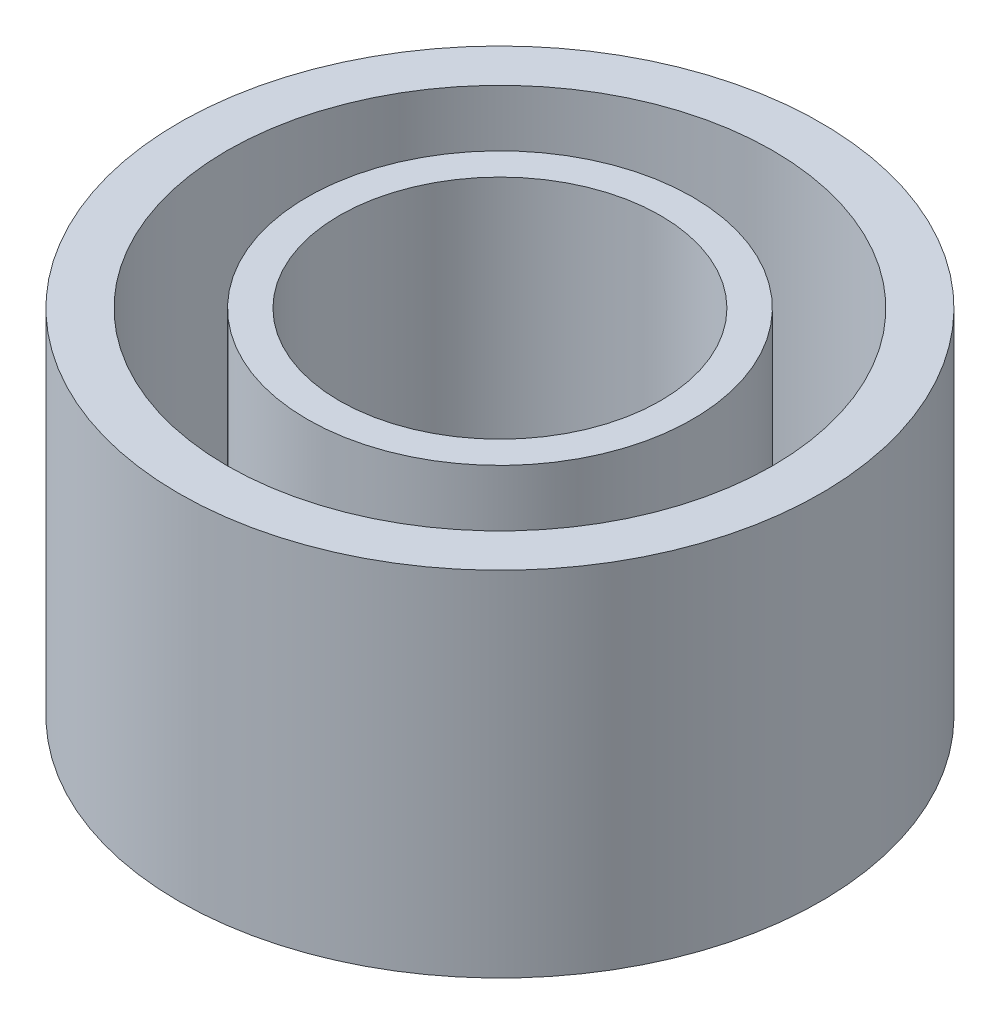
ISO-10303-21;
HEADER;
FILE_DESCRIPTION(('STEP AP214'),'2;1');
FILE_NAME('part.step','',(''),(''),'','','');
FILE_SCHEMA(('AUTOMOTIVE_DESIGN { 1 0 10303 214 1 1 1 1 }'));
ENDSEC;
DATA;
#1=APPLICATION_CONTEXT('core data for automotive mechanical design processes');
#2=APPLICATION_PROTOCOL_DEFINITION('international standard','automotive_design',2000,#1);
#3=PRODUCT_CONTEXT('',#1,'mechanical');
#4=PRODUCT('Part','Part','',(#3));
#5=PRODUCT_RELATED_PRODUCT_CATEGORY('part','',(#4));
#6=PRODUCT_DEFINITION_FORMATION('','',#4);
#7=PRODUCT_DEFINITION_CONTEXT('part definition',#1,'design');
#8=PRODUCT_DEFINITION('design','',#6,#7);
#9=PRODUCT_DEFINITION_SHAPE('','',#8);
#10=(LENGTH_UNIT() NAMED_UNIT(*) SI_UNIT(.MILLI.,.METRE.));
#11=(NAMED_UNIT(*) PLANE_ANGLE_UNIT() SI_UNIT($,.RADIAN.));
#12=(NAMED_UNIT(*) SI_UNIT($,.STERADIAN.) SOLID_ANGLE_UNIT());
#13=UNCERTAINTY_MEASURE_WITH_UNIT(LENGTH_MEASURE(1.E-05),#10,'distance_accuracy_value','');
#14=(GEOMETRIC_REPRESENTATION_CONTEXT(3) GLOBAL_UNCERTAINTY_ASSIGNED_CONTEXT((#13)) GLOBAL_UNIT_ASSIGNED_CONTEXT((#10,
#11,#12)) REPRESENTATION_CONTEXT('',''));
#15=CARTESIAN_POINT('',(0.,0.,0.));
#16=DIRECTION('',(0.,0.,1.));
#17=DIRECTION('',(1.,0.,0.));
#18=AXIS2_PLACEMENT_3D('',#15,#16,#17);
#19=CARTESIAN_POINT('',(-45.0432597664303,11.,0.));
#20=DIRECTION('',(0.,-1.,0.));
#21=DIRECTION('',(0.,0.,-1.));
#22=AXIS2_PLACEMENT_3D('',#19,#20,#21);
#23=CYLINDRICAL_SURFACE('',#22,10.);
#24=CARTESIAN_POINT('',(-45.0432597664303,11.,0.));
#25=DIRECTION('',(0.,1.,0.));
#26=DIRECTION('',(0.,0.,1.));
#27=AXIS2_PLACEMENT_3D('',#24,#25,#26);
#28=CIRCLE('',#27,10.);
#29=CARTESIAN_POINT('',(-45.0432597664303,11.,10.));
#30=VERTEX_POINT('',#29);
#31=EDGE_CURVE('E10',#30,#30,#28,.T.);
#32=ORIENTED_EDGE('',*,*,#31,.F.);
#33=EDGE_LOOP('',(#32));
#34=FACE_BOUND('',#33,.T.);
#35=CARTESIAN_POINT('',(-45.0432597664303,0.,0.));
#36=DIRECTION('',(0.,1.,0.));
#37=DIRECTION('',(0.,0.,1.));
#38=AXIS2_PLACEMENT_3D('',#35,#36,#37);
#39=CIRCLE('',#38,10.);
#40=CARTESIAN_POINT('',(-45.0432597664303,0.,10.));
#41=VERTEX_POINT('',#40);
#42=EDGE_CURVE('E34',#41,#41,#39,.T.);
#43=ORIENTED_EDGE('',*,*,#42,.T.);
#44=EDGE_LOOP('',(#43));
#45=FACE_BOUND('',#44,.T.);
#46=ADVANCED_FACE('F31',(#34,#45),#23,.T.);
#47=CARTESIAN_POINT('',(-45.0432597664303,11.,0.));
#48=DIRECTION('',(0.,1.,0.));
#49=DIRECTION('',(0.,0.,1.));
#50=AXIS2_PLACEMENT_3D('',#47,#48,#49);
#51=PLANE('',#50);
#52=CARTESIAN_POINT('',(-45.0432597664303,11.,0.));
#53=DIRECTION('',(0.,1.,0.));
#54=DIRECTION('',(0.,0.,1.));
#55=AXIS2_PLACEMENT_3D('',#52,#53,#54);
#56=CIRCLE('',#55,8.5);
#57=CARTESIAN_POINT('',(-45.0432597664303,11.,8.5));
#58=VERTEX_POINT('',#57);
#59=EDGE_CURVE('E43',#58,#58,#56,.T.);
#60=ORIENTED_EDGE('',*,*,#59,.F.);
#61=EDGE_LOOP('',(#60));
#62=FACE_BOUND('',#61,.T.);
#63=ORIENTED_EDGE('',*,*,#31,.T.);
#64=EDGE_LOOP('',(#63));
#65=FACE_BOUND('',#64,.T.);
#66=ADVANCED_FACE('F74',(#62,#65),#51,.T.);
#67=CARTESIAN_POINT('',(-45.0432597664303,0.,0.));
#68=DIRECTION('',(0.,1.,0.));
#69=DIRECTION('',(0.,0.,1.));
#70=AXIS2_PLACEMENT_3D('',#67,#68,#69);
#71=PLANE('',#70);
#72=ORIENTED_EDGE('',*,*,#42,.F.);
#73=EDGE_LOOP('',(#72));
#74=FACE_BOUND('',#73,.T.);
#75=ADVANCED_FACE('F92',(#74),#71,.F.);
#76=CARTESIAN_POINT('',(-45.0432597664303,0.999999999999999,0.));
#77=DIRECTION('',(0.,1.,0.));
#78=DIRECTION('',(0.,0.,1.));
#79=AXIS2_PLACEMENT_3D('',#76,#77,#78);
#80=CYLINDRICAL_SURFACE('',#79,8.5);
#81=CARTESIAN_POINT('',(-45.0432597664303,0.999999999999999,0.));
#82=DIRECTION('',(0.,1.,0.));
#83=DIRECTION('',(0.,0.,1.));
#84=AXIS2_PLACEMENT_3D('',#81,#82,#83);
#85=CIRCLE('',#84,8.5);
#86=CARTESIAN_POINT('',(-45.0432597664303,0.999999999999999,8.5));
#87=VERTEX_POINT('',#86);
#88=EDGE_CURVE('E41',#87,#87,#85,.T.);
#89=ORIENTED_EDGE('',*,*,#88,.F.);
#90=EDGE_LOOP('',(#89));
#91=FACE_BOUND('',#90,.T.);
#92=ORIENTED_EDGE('',*,*,#59,.T.);
#93=EDGE_LOOP('',(#92));
#94=FACE_BOUND('',#93,.T.);
#95=ADVANCED_FACE('F84',(#91,#94),#80,.F.);
#96=CARTESIAN_POINT('',(-45.0432597664303,0.999999999999999,0.));
#97=DIRECTION('',(0.,1.,0.));
#98=DIRECTION('',(0.,0.,1.));
#99=AXIS2_PLACEMENT_3D('',#96,#97,#98);
#100=PLANE('',#99);
#101=CARTESIAN_POINT('',(-45.0432597664303,0.999999999999999,0.));
#102=DIRECTION('',(0.,1.,0.));
#103=DIRECTION('',(0.,0.,1.));
#104=AXIS2_PLACEMENT_3D('',#101,#102,#103);
#105=CIRCLE('',#104,6.);
#106=CARTESIAN_POINT('',(-45.0432597664303,0.999999999999999,6.));
#107=VERTEX_POINT('',#106);
#108=EDGE_CURVE('E46',#107,#107,#105,.T.);
#109=ORIENTED_EDGE('',*,*,#108,.F.);
#110=EDGE_LOOP('',(#109));
#111=FACE_BOUND('',#110,.T.);
#112=ORIENTED_EDGE('',*,*,#88,.T.);
#113=EDGE_LOOP('',(#112));
#114=FACE_BOUND('',#113,.T.);
#115=ADVANCED_FACE('F78',(#111,#114),#100,.T.);
#116=CARTESIAN_POINT('',(-45.0432597664303,0.999999999999999,0.));
#117=DIRECTION('',(0.,1.,0.));
#118=DIRECTION('',(0.,0.,1.));
#119=AXIS2_PLACEMENT_3D('',#116,#117,#118);
#120=CYLINDRICAL_SURFACE('',#119,6.);
#121=ORIENTED_EDGE('',*,*,#108,.T.);
#122=EDGE_LOOP('',(#121));
#123=FACE_BOUND('',#122,.T.);
#124=CARTESIAN_POINT('',(-45.0432597664303,11.,0.));
#125=DIRECTION('',(0.,1.,0.));
#126=DIRECTION('',(0.,0.,1.));
#127=AXIS2_PLACEMENT_3D('',#124,#125,#126);
#128=CIRCLE('',#127,6.);
#129=CARTESIAN_POINT('',(-45.0432597664303,11.,6.));
#130=VERTEX_POINT('',#129);
#131=EDGE_CURVE('E49',#130,#130,#128,.T.);
#132=ORIENTED_EDGE('',*,*,#131,.F.);
#133=EDGE_LOOP('',(#132));
#134=FACE_BOUND('',#133,.T.);
#135=ADVANCED_FACE('F72',(#123,#134),#120,.T.);
#136=CARTESIAN_POINT('',(-45.0432597664303,11.,0.));
#137=DIRECTION('',(0.,1.,0.));
#138=DIRECTION('',(0.,0.,1.));
#139=AXIS2_PLACEMENT_3D('',#136,#137,#138);
#140=CIRCLE('',#139,5.);
#141=CARTESIAN_POINT('',(-45.0432597664303,11.,5.));
#142=VERTEX_POINT('',#141);
#143=EDGE_CURVE('E55',#142,#142,#140,.T.);
#144=ORIENTED_EDGE('',*,*,#143,.F.);
#145=EDGE_LOOP('',(#144));
#146=FACE_BOUND('',#145,.T.);
#147=ORIENTED_EDGE('',*,*,#131,.T.);
#148=EDGE_LOOP('',(#147));
#149=FACE_BOUND('',#148,.T.);
#150=ADVANCED_FACE('F66',(#146,#149),#51,.T.);
#151=CARTESIAN_POINT('',(-45.0432597664303,0.999999999999999,0.));
#152=DIRECTION('',(0.,1.,0.));
#153=DIRECTION('',(0.,0.,1.));
#154=AXIS2_PLACEMENT_3D('',#151,#152,#153);
#155=CYLINDRICAL_SURFACE('',#154,5.);
#156=CARTESIAN_POINT('',(-45.0432597664303,0.999999999999999,0.));
#157=DIRECTION('',(0.,1.,0.));
#158=DIRECTION('',(0.,0.,1.));
#159=AXIS2_PLACEMENT_3D('',#156,#157,#158);
#160=CIRCLE('',#159,5.);
#161=CARTESIAN_POINT('',(-45.0432597664303,0.999999999999999,5.));
#162=VERTEX_POINT('',#161);
#163=EDGE_CURVE('E52',#162,#162,#160,.T.);
#164=ORIENTED_EDGE('',*,*,#163,.F.);
#165=EDGE_LOOP('',(#164));
#166=FACE_BOUND('',#165,.T.);
#167=ORIENTED_EDGE('',*,*,#143,.T.);
#168=EDGE_LOOP('',(#167));
#169=FACE_BOUND('',#168,.T.);
#170=ADVANCED_FACE('F63',(#166,#169),#155,.F.);
#171=CARTESIAN_POINT('',(-45.0432597664303,0.999999999999999,0.));
#172=DIRECTION('',(0.,1.,0.));
#173=DIRECTION('',(0.,0.,1.));
#174=AXIS2_PLACEMENT_3D('',#171,#172,#173);
#175=PLANE('',#174);
#176=ORIENTED_EDGE('',*,*,#163,.T.);
#177=EDGE_LOOP('',(#176));
#178=FACE_BOUND('',#177,.T.);
#179=ADVANCED_FACE('F61',(#178),#175,.T.);
#180=CLOSED_SHELL('',(#46,#66,#75,#95,#115,#135,#150,#170,#179));
#181=MANIFOLD_SOLID_BREP('B2',#180);
#182=ADVANCED_BREP_SHAPE_REPRESENTATION('',(#18,#181),#14);
#183=SHAPE_DEFINITION_REPRESENTATION(#9,#182);
ENDSEC;
END-ISO-10303-21;
